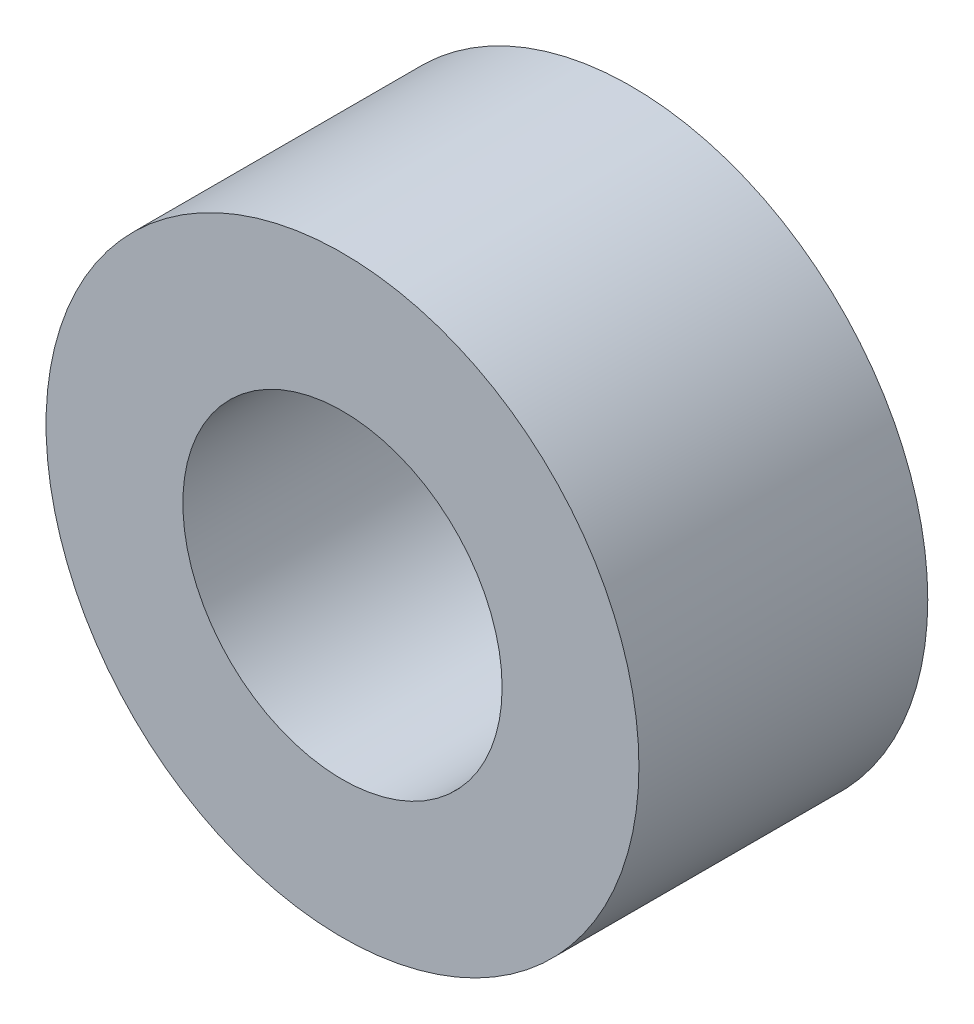
ISO-10303-21;
HEADER;
FILE_DESCRIPTION(('STEP AP214'),'2;1');
FILE_NAME('part.step','',(''),(''),'','','');
FILE_SCHEMA(('AUTOMOTIVE_DESIGN { 1 0 10303 214 1 1 1 1 }'));
ENDSEC;
DATA;
#1=APPLICATION_CONTEXT('core data for automotive mechanical design processes');
#2=APPLICATION_PROTOCOL_DEFINITION('international standard','automotive_design',2000,#1);
#3=PRODUCT_CONTEXT('',#1,'mechanical');
#4=PRODUCT('Part','Part','',(#3));
#5=PRODUCT_RELATED_PRODUCT_CATEGORY('part','',(#4));
#6=PRODUCT_DEFINITION_FORMATION('','',#4);
#7=PRODUCT_DEFINITION_CONTEXT('part definition',#1,'design');
#8=PRODUCT_DEFINITION('design','',#6,#7);
#9=PRODUCT_DEFINITION_SHAPE('','',#8);
#10=(LENGTH_UNIT() NAMED_UNIT(*) SI_UNIT(.MILLI.,.METRE.));
#11=(NAMED_UNIT(*) PLANE_ANGLE_UNIT() SI_UNIT($,.RADIAN.));
#12=(NAMED_UNIT(*) SI_UNIT($,.STERADIAN.) SOLID_ANGLE_UNIT());
#13=UNCERTAINTY_MEASURE_WITH_UNIT(LENGTH_MEASURE(1.E-05),#10,'distance_accuracy_value','');
#14=(GEOMETRIC_REPRESENTATION_CONTEXT(3) GLOBAL_UNCERTAINTY_ASSIGNED_CONTEXT((#13)) GLOBAL_UNIT_ASSIGNED_CONTEXT((#10,
#11,#12)) REPRESENTATION_CONTEXT('',''));
#15=CARTESIAN_POINT('',(0.,0.,0.));
#16=DIRECTION('',(0.,0.,1.));
#17=DIRECTION('',(1.,0.,0.));
#18=AXIS2_PLACEMENT_3D('',#15,#16,#17);
#19=CARTESIAN_POINT('',(0.,0.,19.));
#20=DIRECTION('',(0.,0.,1.));
#21=DIRECTION('',(1.,0.,0.));
#22=AXIS2_PLACEMENT_3D('',#19,#20,#21);
#23=PLANE('',#22);
#24=CARTESIAN_POINT('',(0.,0.,19.));
#25=DIRECTION('',(0.,0.,1.));
#26=DIRECTION('',(1.,0.,0.));
#27=AXIS2_PLACEMENT_3D('',#24,#25,#26);
#28=CIRCLE('',#27,19.5);
#29=CARTESIAN_POINT('',(19.5,0.,19.));
#30=VERTEX_POINT('',#29);
#31=EDGE_CURVE('E10',#30,#30,#28,.T.);
#32=ORIENTED_EDGE('',*,*,#31,.T.);
#33=EDGE_LOOP('',(#32));
#34=FACE_BOUND('',#33,.T.);
#35=CARTESIAN_POINT('',(0.,0.,19.));
#36=DIRECTION('',(0.,0.,1.));
#37=DIRECTION('',(1.,0.,0.));
#38=AXIS2_PLACEMENT_3D('',#35,#36,#37);
#39=CIRCLE('',#38,10.5);
#40=CARTESIAN_POINT('',(10.5,0.,19.));
#41=VERTEX_POINT('',#40);
#42=EDGE_CURVE('E41',#41,#41,#39,.T.);
#43=ORIENTED_EDGE('',*,*,#42,.F.);
#44=EDGE_LOOP('',(#43));
#45=FACE_BOUND('',#44,.T.);
#46=ADVANCED_FACE('F30',(#34,#45),#23,.T.);
#47=CARTESIAN_POINT('',(0.,0.,0.));
#48=DIRECTION('',(0.,0.,1.));
#49=DIRECTION('',(1.,0.,0.));
#50=AXIS2_PLACEMENT_3D('',#47,#48,#49);
#51=PLANE('',#50);
#52=CARTESIAN_POINT('',(0.,0.,0.));
#53=DIRECTION('',(0.,0.,1.));
#54=DIRECTION('',(1.,0.,0.));
#55=AXIS2_PLACEMENT_3D('',#52,#53,#54);
#56=CIRCLE('',#55,19.5);
#57=CARTESIAN_POINT('',(19.5,0.,0.));
#58=VERTEX_POINT('',#57);
#59=EDGE_CURVE('E34',#58,#58,#56,.T.);
#60=ORIENTED_EDGE('',*,*,#59,.F.);
#61=EDGE_LOOP('',(#60));
#62=FACE_BOUND('',#61,.T.);
#63=CARTESIAN_POINT('',(0.,0.,0.));
#64=DIRECTION('',(0.,0.,1.));
#65=DIRECTION('',(1.,0.,0.));
#66=AXIS2_PLACEMENT_3D('',#63,#64,#65);
#67=CIRCLE('',#66,10.5);
#68=CARTESIAN_POINT('',(10.5,0.,0.));
#69=VERTEX_POINT('',#68);
#70=EDGE_CURVE('E43',#69,#69,#67,.T.);
#71=ORIENTED_EDGE('',*,*,#70,.T.);
#72=EDGE_LOOP('',(#71));
#73=FACE_BOUND('',#72,.T.);
#74=ADVANCED_FACE('F53',(#62,#73),#51,.F.);
#75=CARTESIAN_POINT('',(0.,0.,19.));
#76=DIRECTION('',(0.,0.,-1.));
#77=DIRECTION('',(-1.,0.,0.));
#78=AXIS2_PLACEMENT_3D('',#75,#76,#77);
#79=CYLINDRICAL_SURFACE('',#78,19.5);
#80=ORIENTED_EDGE('',*,*,#31,.F.);
#81=EDGE_LOOP('',(#80));
#82=FACE_BOUND('',#81,.T.);
#83=ORIENTED_EDGE('',*,*,#59,.T.);
#84=EDGE_LOOP('',(#83));
#85=FACE_BOUND('',#84,.T.);
#86=ADVANCED_FACE('F32',(#82,#85),#79,.T.);
#87=CARTESIAN_POINT('',(0.,0.,19.));
#88=DIRECTION('',(0.,0.,-1.));
#89=DIRECTION('',(-1.,0.,0.));
#90=AXIS2_PLACEMENT_3D('',#87,#88,#89);
#91=CYLINDRICAL_SURFACE('',#90,10.5);
#92=ORIENTED_EDGE('',*,*,#42,.T.);
#93=EDGE_LOOP('',(#92));
#94=FACE_BOUND('',#93,.T.);
#95=ORIENTED_EDGE('',*,*,#70,.F.);
#96=EDGE_LOOP('',(#95));
#97=FACE_BOUND('',#96,.T.);
#98=ADVANCED_FACE('F49',(#94,#97),#91,.F.);
#99=CLOSED_SHELL('',(#46,#74,#86,#98));
#100=MANIFOLD_SOLID_BREP('B2',#99);
#101=ADVANCED_BREP_SHAPE_REPRESENTATION('',(#18,#100),#14);
#102=SHAPE_DEFINITION_REPRESENTATION(#9,#101);
ENDSEC;
END-ISO-10303-21;
